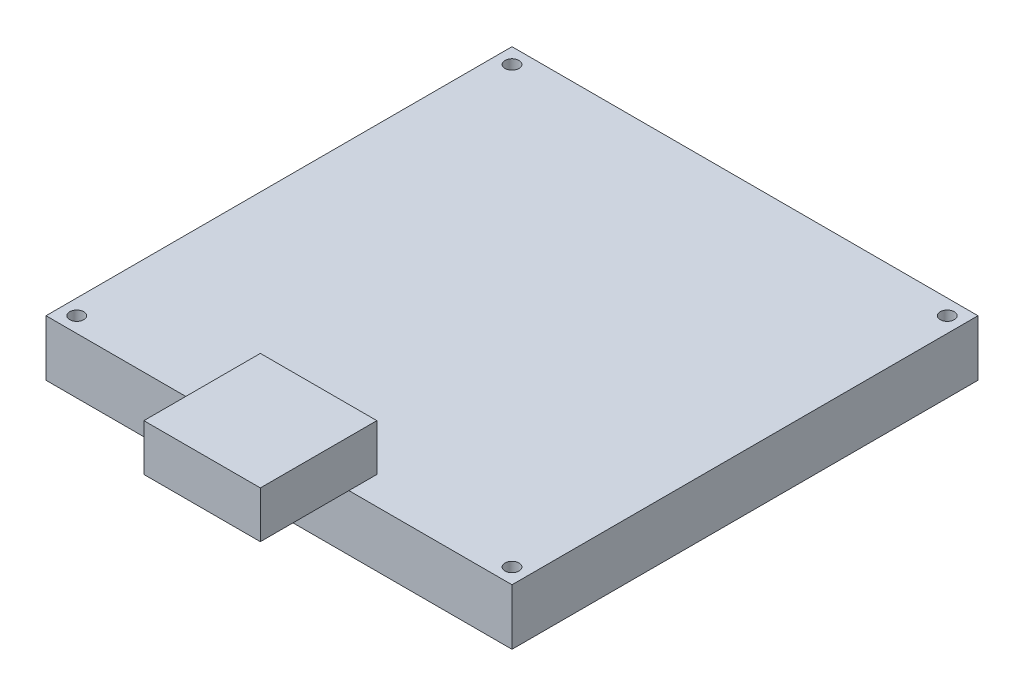
ISO-10303-21;
HEADER;
FILE_DESCRIPTION(('STEP AP214'),'2;1');
FILE_NAME('part.step','',(''),(''),'','','');
FILE_SCHEMA(('AUTOMOTIVE_DESIGN { 1 0 10303 214 1 1 1 1 }'));
ENDSEC;
DATA;
#1=APPLICATION_CONTEXT('core data for automotive mechanical design processes');
#2=APPLICATION_PROTOCOL_DEFINITION('international standard','automotive_design',2000,#1);
#3=PRODUCT_CONTEXT('',#1,'mechanical');
#4=PRODUCT('Part','Part','',(#3));
#5=PRODUCT_RELATED_PRODUCT_CATEGORY('part','',(#4));
#6=PRODUCT_DEFINITION_FORMATION('','',#4);
#7=PRODUCT_DEFINITION_CONTEXT('part definition',#1,'design');
#8=PRODUCT_DEFINITION('design','',#6,#7);
#9=PRODUCT_DEFINITION_SHAPE('','',#8);
#10=(LENGTH_UNIT() NAMED_UNIT(*) SI_UNIT(.MILLI.,.METRE.));
#11=(NAMED_UNIT(*) PLANE_ANGLE_UNIT() SI_UNIT($,.RADIAN.));
#12=(NAMED_UNIT(*) SI_UNIT($,.STERADIAN.) SOLID_ANGLE_UNIT());
#13=UNCERTAINTY_MEASURE_WITH_UNIT(LENGTH_MEASURE(1.E-05),#10,'distance_accuracy_value','');
#14=(GEOMETRIC_REPRESENTATION_CONTEXT(3) GLOBAL_UNCERTAINTY_ASSIGNED_CONTEXT((#13)) GLOBAL_UNIT_ASSIGNED_CONTEXT((#10,
#11,#12)) REPRESENTATION_CONTEXT('',''));
#15=CARTESIAN_POINT('',(0.,0.,0.));
#16=DIRECTION('',(0.,0.,1.));
#17=DIRECTION('',(1.,0.,0.));
#18=AXIS2_PLACEMENT_3D('',#15,#16,#17);
#19=CARTESIAN_POINT('',(0.,12.,0.));
#20=DIRECTION('',(0.,1.,0.));
#21=DIRECTION('',(0.,0.,1.));
#22=AXIS2_PLACEMENT_3D('',#19,#20,#21);
#23=PLANE('',#22);
#24=DIRECTION('',(0.,0.,-1.));
#25=VECTOR('',#24,1.);
#26=CARTESIAN_POINT('',(65.,12.,-6.));
#27=LINE('',#26,#25);
#28=CARTESIAN_POINT('',(65.,12.,0.));
#29=VERTEX_POINT('',#28);
#30=CARTESIAN_POINT('',(65.,12.,-6.));
#31=VERTEX_POINT('',#30);
#32=EDGE_CURVE('E12',#29,#31,#27,.T.);
#33=ORIENTED_EDGE('',*,*,#32,.F.);
#34=DIRECTION('',(1.,0.,0.));
#35=VECTOR('',#34,1.);
#36=CARTESIAN_POINT('',(0.,12.,0.));
#37=LINE('',#36,#35);
#38=CARTESIAN_POINT('',(100.,12.,0.));
#39=VERTEX_POINT('',#38);
#40=EDGE_CURVE('E167',#29,#39,#37,.T.);
#41=ORIENTED_EDGE('',*,*,#40,.T.);
#42=DIRECTION('',(0.,0.,-1.));
#43=VECTOR('',#42,1.);
#44=CARTESIAN_POINT('',(100.,12.,0.));
#45=LINE('',#44,#43);
#46=CARTESIAN_POINT('',(100.,12.,-100.));
#47=VERTEX_POINT('',#46);
#48=EDGE_CURVE('E171',#39,#47,#45,.T.);
#49=ORIENTED_EDGE('',*,*,#48,.T.);
#50=DIRECTION('',(1.,0.,0.));
#51=VECTOR('',#50,1.);
#52=CARTESIAN_POINT('',(0.,12.,-100.));
#53=LINE('',#52,#51);
#54=CARTESIAN_POINT('',(0.,12.,-100.));
#55=VERTEX_POINT('',#54);
#56=EDGE_CURVE('E174',#55,#47,#53,.T.);
#57=ORIENTED_EDGE('',*,*,#56,.F.);
#58=DIRECTION('',(0.,0.,-1.));
#59=VECTOR('',#58,1.);
#60=CARTESIAN_POINT('',(0.,12.,0.));
#61=LINE('',#60,#59);
#62=CARTESIAN_POINT('',(0.,12.,0.));
#63=VERTEX_POINT('',#62);
#64=EDGE_CURVE('E177',#63,#55,#61,.T.);
#65=ORIENTED_EDGE('',*,*,#64,.F.);
#66=CARTESIAN_POINT('',(40.,12.,0.));
#67=VERTEX_POINT('',#66);
#68=EDGE_CURVE('E168',#63,#67,#37,.T.);
#69=ORIENTED_EDGE('',*,*,#68,.T.);
#70=DIRECTION('',(0.,0.,1.));
#71=VECTOR('',#70,1.);
#72=CARTESIAN_POINT('',(40.,12.,-6.));
#73=LINE('',#72,#71);
#74=CARTESIAN_POINT('',(40.,12.,-6.));
#75=VERTEX_POINT('',#74);
#76=EDGE_CURVE('E387',#75,#67,#73,.T.);
#77=ORIENTED_EDGE('',*,*,#76,.F.);
#78=DIRECTION('',(-1.,0.,0.));
#79=VECTOR('',#78,1.);
#80=CARTESIAN_POINT('',(65.,12.,-6.));
#81=LINE('',#80,#79);
#82=EDGE_CURVE('E70',#31,#75,#81,.T.);
#83=ORIENTED_EDGE('',*,*,#82,.F.);
#84=EDGE_LOOP('',(#33,#41,#49,#57,#65,#69,#77,#83));
#85=FACE_BOUND('',#84,.T.);
#86=CARTESIAN_POINT('',(96.7,12.,-96.7));
#87=DIRECTION('',(0.,1.,0.));
#88=DIRECTION('',(0.,0.,1.));
#89=AXIS2_PLACEMENT_3D('',#86,#87,#88);
#90=CIRCLE('',#89,1.5);
#91=CARTESIAN_POINT('',(96.7,12.,-95.2));
#92=VERTEX_POINT('',#91);
#93=EDGE_CURVE('E164',#92,#92,#90,.T.);
#94=ORIENTED_EDGE('',*,*,#93,.F.);
#95=EDGE_LOOP('',(#94));
#96=FACE_BOUND('',#95,.T.);
#97=CARTESIAN_POINT('',(96.7,12.,-3.3));
#98=DIRECTION('',(0.,1.,0.));
#99=DIRECTION('',(0.,0.,1.));
#100=AXIS2_PLACEMENT_3D('',#97,#98,#99);
#101=CIRCLE('',#100,1.5);
#102=CARTESIAN_POINT('',(96.7,12.,-1.8));
#103=VERTEX_POINT('',#102);
#104=EDGE_CURVE('E160',#103,#103,#101,.T.);
#105=ORIENTED_EDGE('',*,*,#104,.F.);
#106=EDGE_LOOP('',(#105));
#107=FACE_BOUND('',#106,.T.);
#108=CARTESIAN_POINT('',(3.3,12.,-3.3));
#109=DIRECTION('',(0.,1.,0.));
#110=DIRECTION('',(0.,0.,1.));
#111=AXIS2_PLACEMENT_3D('',#108,#109,#110);
#112=CIRCLE('',#111,1.5);
#113=CARTESIAN_POINT('',(3.3,12.,-1.8));
#114=VERTEX_POINT('',#113);
#115=EDGE_CURVE('E157',#114,#114,#112,.T.);
#116=ORIENTED_EDGE('',*,*,#115,.F.);
#117=EDGE_LOOP('',(#116));
#118=FACE_BOUND('',#117,.T.);
#119=CARTESIAN_POINT('',(3.3,12.,-96.7));
#120=DIRECTION('',(0.,1.,0.));
#121=DIRECTION('',(0.,0.,1.));
#122=AXIS2_PLACEMENT_3D('',#119,#120,#121);
#123=CIRCLE('',#122,1.5);
#124=CARTESIAN_POINT('',(3.3,12.,-95.2));
#125=VERTEX_POINT('',#124);
#126=EDGE_CURVE('E148',#125,#125,#123,.T.);
#127=ORIENTED_EDGE('',*,*,#126,.F.);
#128=EDGE_LOOP('',(#127));
#129=FACE_BOUND('',#128,.T.);
#130=ADVANCED_FACE('F53',(#85,#96,#107,#118,#129),#23,.T.);
#131=CARTESIAN_POINT('',(0.,0.,0.));
#132=DIRECTION('',(0.,1.,0.));
#133=DIRECTION('',(0.,0.,1.));
#134=AXIS2_PLACEMENT_3D('',#131,#132,#133);
#135=PLANE('',#134);
#136=CARTESIAN_POINT('',(3.3,0.,-3.3));
#137=DIRECTION('',(0.,1.,0.));
#138=DIRECTION('',(0.,0.,1.));
#139=AXIS2_PLACEMENT_3D('',#136,#137,#138);
#140=CIRCLE('',#139,1.5);
#141=CARTESIAN_POINT('',(3.3,0.,-1.8));
#142=VERTEX_POINT('',#141);
#143=EDGE_CURVE('E155',#142,#142,#140,.T.);
#144=ORIENTED_EDGE('',*,*,#143,.T.);
#145=EDGE_LOOP('',(#144));
#146=FACE_BOUND('',#145,.T.);
#147=CARTESIAN_POINT('',(96.7,0.,-3.3));
#148=DIRECTION('',(0.,1.,0.));
#149=DIRECTION('',(0.,0.,1.));
#150=AXIS2_PLACEMENT_3D('',#147,#148,#149);
#151=CIRCLE('',#150,1.5);
#152=CARTESIAN_POINT('',(96.7,0.,-1.8));
#153=VERTEX_POINT('',#152);
#154=EDGE_CURVE('E183',#153,#153,#151,.T.);
#155=ORIENTED_EDGE('',*,*,#154,.T.);
#156=EDGE_LOOP('',(#155));
#157=FACE_BOUND('',#156,.T.);
#158=CARTESIAN_POINT('',(96.7,0.,-96.7));
#159=DIRECTION('',(0.,1.,0.));
#160=DIRECTION('',(0.,0.,1.));
#161=AXIS2_PLACEMENT_3D('',#158,#159,#160);
#162=CIRCLE('',#161,1.5);
#163=CARTESIAN_POINT('',(96.7,0.,-95.2));
#164=VERTEX_POINT('',#163);
#165=EDGE_CURVE('E186',#164,#164,#162,.T.);
#166=ORIENTED_EDGE('',*,*,#165,.T.);
#167=EDGE_LOOP('',(#166));
#168=FACE_BOUND('',#167,.T.);
#169=DIRECTION('',(1.,0.,0.));
#170=VECTOR('',#169,1.);
#171=CARTESIAN_POINT('',(0.,0.,0.));
#172=LINE('',#171,#170);
#173=CARTESIAN_POINT('',(0.,0.,0.));
#174=VERTEX_POINT('',#173);
#175=CARTESIAN_POINT('',(100.,0.,0.));
#176=VERTEX_POINT('',#175);
#177=EDGE_CURVE('E189',#174,#176,#172,.T.);
#178=ORIENTED_EDGE('',*,*,#177,.F.);
#179=DIRECTION('',(0.,0.,-1.));
#180=VECTOR('',#179,1.);
#181=CARTESIAN_POINT('',(0.,0.,0.));
#182=LINE('',#181,#180);
#183=CARTESIAN_POINT('',(0.,0.,-100.));
#184=VERTEX_POINT('',#183);
#185=EDGE_CURVE('E161',#174,#184,#182,.T.);
#186=ORIENTED_EDGE('',*,*,#185,.T.);
#187=DIRECTION('',(1.,0.,0.));
#188=VECTOR('',#187,1.);
#189=CARTESIAN_POINT('',(0.,0.,-100.));
#190=LINE('',#189,#188);
#191=CARTESIAN_POINT('',(100.,0.,-100.));
#192=VERTEX_POINT('',#191);
#193=EDGE_CURVE('E195',#184,#192,#190,.T.);
#194=ORIENTED_EDGE('',*,*,#193,.T.);
#195=DIRECTION('',(0.,0.,-1.));
#196=VECTOR('',#195,1.);
#197=CARTESIAN_POINT('',(100.,0.,0.));
#198=LINE('',#197,#196);
#199=EDGE_CURVE('E192',#176,#192,#198,.T.);
#200=ORIENTED_EDGE('',*,*,#199,.F.);
#201=EDGE_LOOP('',(#178,#186,#194,#200));
#202=FACE_BOUND('',#201,.T.);
#203=CARTESIAN_POINT('',(3.3,0.,-96.7));
#204=DIRECTION('',(0.,1.,0.));
#205=DIRECTION('',(0.,0.,1.));
#206=AXIS2_PLACEMENT_3D('',#203,#204,#205);
#207=CIRCLE('',#206,1.5);
#208=CARTESIAN_POINT('',(3.3,0.,-95.2));
#209=VERTEX_POINT('',#208);
#210=EDGE_CURVE('E145',#209,#209,#207,.T.);
#211=ORIENTED_EDGE('',*,*,#210,.T.);
#212=EDGE_LOOP('',(#211));
#213=FACE_BOUND('',#212,.T.);
#214=ADVANCED_FACE('F217',(#146,#157,#168,#202,#213),#135,.F.);
#215=CARTESIAN_POINT('',(0.,12.,0.));
#216=DIRECTION('',(0.,0.,-1.));
#217=DIRECTION('',(-1.,0.,0.));
#218=AXIS2_PLACEMENT_3D('',#215,#216,#217);
#219=PLANE('',#218);
#220=ORIENTED_EDGE('',*,*,#177,.T.);
#221=DIRECTION('',(0.,-1.,0.));
#222=VECTOR('',#221,1.);
#223=CARTESIAN_POINT('',(100.,12.,0.));
#224=LINE('',#223,#222);
#225=EDGE_CURVE('E57',#39,#176,#224,.T.);
#226=ORIENTED_EDGE('',*,*,#225,.F.);
#227=ORIENTED_EDGE('',*,*,#40,.F.);
#228=EDGE_CURVE('E172',#67,#29,#37,.T.);
#229=ORIENTED_EDGE('',*,*,#228,.F.);
#230=ORIENTED_EDGE('',*,*,#68,.F.);
#231=DIRECTION('',(0.,-1.,0.));
#232=VECTOR('',#231,1.);
#233=CARTESIAN_POINT('',(0.,12.,0.));
#234=LINE('',#233,#232);
#235=EDGE_CURVE('E180',#63,#174,#234,.T.);
#236=ORIENTED_EDGE('',*,*,#235,.T.);
#237=EDGE_LOOP('',(#220,#226,#227,#229,#230,#236));
#238=FACE_BOUND('',#237,.T.);
#239=ADVANCED_FACE('F213',(#238),#219,.F.);
#240=CARTESIAN_POINT('',(100.,12.,0.));
#241=DIRECTION('',(-1.,0.,0.));
#242=DIRECTION('',(0.,0.,1.));
#243=AXIS2_PLACEMENT_3D('',#240,#241,#242);
#244=PLANE('',#243);
#245=ORIENTED_EDGE('',*,*,#199,.T.);
#246=DIRECTION('',(0.,-1.,0.));
#247=VECTOR('',#246,1.);
#248=CARTESIAN_POINT('',(100.,12.,-100.));
#249=LINE('',#248,#247);
#250=EDGE_CURVE('E202',#47,#192,#249,.T.);
#251=ORIENTED_EDGE('',*,*,#250,.F.);
#252=ORIENTED_EDGE('',*,*,#48,.F.);
#253=ORIENTED_EDGE('',*,*,#225,.T.);
#254=EDGE_LOOP('',(#245,#251,#252,#253));
#255=FACE_BOUND('',#254,.T.);
#256=ADVANCED_FACE('F210',(#255),#244,.F.);
#257=CARTESIAN_POINT('',(0.,12.,-100.));
#258=DIRECTION('',(0.,0.,-1.));
#259=DIRECTION('',(-1.,0.,0.));
#260=AXIS2_PLACEMENT_3D('',#257,#258,#259);
#261=PLANE('',#260);
#262=ORIENTED_EDGE('',*,*,#193,.F.);
#263=DIRECTION('',(0.,-1.,0.));
#264=VECTOR('',#263,1.);
#265=CARTESIAN_POINT('',(0.,12.,-100.));
#266=LINE('',#265,#264);
#267=EDGE_CURVE('E201',#55,#184,#266,.T.);
#268=ORIENTED_EDGE('',*,*,#267,.F.);
#269=ORIENTED_EDGE('',*,*,#56,.T.);
#270=ORIENTED_EDGE('',*,*,#250,.T.);
#271=EDGE_LOOP('',(#262,#268,#269,#270));
#272=FACE_BOUND('',#271,.T.);
#273=ADVANCED_FACE('F223',(#272),#261,.T.);
#274=CARTESIAN_POINT('',(96.7,12.,-96.7));
#275=DIRECTION('',(0.,-1.,0.));
#276=DIRECTION('',(0.,0.,-1.));
#277=AXIS2_PLACEMENT_3D('',#274,#275,#276);
#278=CYLINDRICAL_SURFACE('',#277,1.5);
#279=ORIENTED_EDGE('',*,*,#93,.T.);
#280=EDGE_LOOP('',(#279));
#281=FACE_BOUND('',#280,.T.);
#282=ORIENTED_EDGE('',*,*,#165,.F.);
#283=EDGE_LOOP('',(#282));
#284=FACE_BOUND('',#283,.T.);
#285=ADVANCED_FACE('F225',(#281,#284),#278,.F.);
#286=CARTESIAN_POINT('',(96.7,12.,-3.3));
#287=DIRECTION('',(0.,-1.,0.));
#288=DIRECTION('',(0.,0.,-1.));
#289=AXIS2_PLACEMENT_3D('',#286,#287,#288);
#290=CYLINDRICAL_SURFACE('',#289,1.5);
#291=ORIENTED_EDGE('',*,*,#104,.T.);
#292=EDGE_LOOP('',(#291));
#293=FACE_BOUND('',#292,.T.);
#294=ORIENTED_EDGE('',*,*,#154,.F.);
#295=EDGE_LOOP('',(#294));
#296=FACE_BOUND('',#295,.T.);
#297=ADVANCED_FACE('F231',(#293,#296),#290,.F.);
#298=CARTESIAN_POINT('',(3.3,12.,-3.3));
#299=DIRECTION('',(0.,-1.,0.));
#300=DIRECTION('',(0.,0.,-1.));
#301=AXIS2_PLACEMENT_3D('',#298,#299,#300);
#302=CYLINDRICAL_SURFACE('',#301,1.5);
#303=ORIENTED_EDGE('',*,*,#115,.T.);
#304=EDGE_LOOP('',(#303));
#305=FACE_BOUND('',#304,.T.);
#306=ORIENTED_EDGE('',*,*,#143,.F.);
#307=EDGE_LOOP('',(#306));
#308=FACE_BOUND('',#307,.T.);
#309=ADVANCED_FACE('F55',(#305,#308),#302,.F.);
#310=CARTESIAN_POINT('',(0.,12.,0.));
#311=DIRECTION('',(-1.,0.,0.));
#312=DIRECTION('',(0.,0.,1.));
#313=AXIS2_PLACEMENT_3D('',#310,#311,#312);
#314=PLANE('',#313);
#315=ORIENTED_EDGE('',*,*,#185,.F.);
#316=ORIENTED_EDGE('',*,*,#235,.F.);
#317=ORIENTED_EDGE('',*,*,#64,.T.);
#318=ORIENTED_EDGE('',*,*,#267,.T.);
#319=EDGE_LOOP('',(#315,#316,#317,#318));
#320=FACE_BOUND('',#319,.T.);
#321=ADVANCED_FACE('F220',(#320),#314,.T.);
#322=CARTESIAN_POINT('',(3.3,12.,-96.7));
#323=DIRECTION('',(0.,-1.,0.));
#324=DIRECTION('',(0.,0.,-1.));
#325=AXIS2_PLACEMENT_3D('',#322,#323,#324);
#326=CYLINDRICAL_SURFACE('',#325,1.5);
#327=ORIENTED_EDGE('',*,*,#126,.T.);
#328=EDGE_LOOP('',(#327));
#329=FACE_BOUND('',#328,.T.);
#330=ORIENTED_EDGE('',*,*,#210,.F.);
#331=EDGE_LOOP('',(#330));
#332=FACE_BOUND('',#331,.T.);
#333=ADVANCED_FACE('F245',(#329,#332),#326,.F.);
#334=CARTESIAN_POINT('',(65.,22.,-6.));
#335=DIRECTION('',(-1.,0.,0.));
#336=DIRECTION('',(0.,0.,1.));
#337=AXIS2_PLACEMENT_3D('',#334,#335,#336);
#338=PLANE('',#337);
#339=CARTESIAN_POINT('',(65.,12.,19.));
#340=VERTEX_POINT('',#339);
#341=EDGE_CURVE('E63',#340,#29,#27,.T.);
#342=ORIENTED_EDGE('',*,*,#341,.T.);
#343=ORIENTED_EDGE('',*,*,#32,.T.);
#344=DIRECTION('',(0.,-1.,0.));
#345=VECTOR('',#344,1.);
#346=CARTESIAN_POINT('',(65.,22.,-6.));
#347=LINE('',#346,#345);
#348=CARTESIAN_POINT('',(65.,22.,-6.));
#349=VERTEX_POINT('',#348);
#350=EDGE_CURVE('E126',#349,#31,#347,.T.);
#351=ORIENTED_EDGE('',*,*,#350,.F.);
#352=DIRECTION('',(0.,0.,-1.));
#353=VECTOR('',#352,1.);
#354=CARTESIAN_POINT('',(65.,22.,-6.));
#355=LINE('',#354,#353);
#356=CARTESIAN_POINT('',(65.,22.,19.));
#357=VERTEX_POINT('',#356);
#358=EDGE_CURVE('E132',#357,#349,#355,.T.);
#359=ORIENTED_EDGE('',*,*,#358,.F.);
#360=DIRECTION('',(0.,-1.,0.));
#361=VECTOR('',#360,1.);
#362=CARTESIAN_POINT('',(65.,22.,19.));
#363=LINE('',#362,#361);
#364=EDGE_CURVE('E392',#357,#340,#363,.T.);
#365=ORIENTED_EDGE('',*,*,#364,.T.);
#366=EDGE_LOOP('',(#342,#343,#351,#359,#365));
#367=FACE_BOUND('',#366,.T.);
#368=ADVANCED_FACE('F144',(#367),#338,.F.);
#369=CARTESIAN_POINT('',(65.,22.,-6.));
#370=DIRECTION('',(0.,0.,1.));
#371=DIRECTION('',(1.,0.,0.));
#372=AXIS2_PLACEMENT_3D('',#369,#370,#371);
#373=PLANE('',#372);
#374=ORIENTED_EDGE('',*,*,#82,.T.);
#375=DIRECTION('',(0.,-1.,0.));
#376=VECTOR('',#375,1.);
#377=CARTESIAN_POINT('',(40.,22.,-6.));
#378=LINE('',#377,#376);
#379=CARTESIAN_POINT('',(40.,22.,-6.));
#380=VERTEX_POINT('',#379);
#381=EDGE_CURVE('E128',#380,#75,#378,.T.);
#382=ORIENTED_EDGE('',*,*,#381,.F.);
#383=DIRECTION('',(-1.,0.,0.));
#384=VECTOR('',#383,1.);
#385=CARTESIAN_POINT('',(65.,22.,-6.));
#386=LINE('',#385,#384);
#387=EDGE_CURVE('E122',#349,#380,#386,.T.);
#388=ORIENTED_EDGE('',*,*,#387,.F.);
#389=ORIENTED_EDGE('',*,*,#350,.T.);
#390=EDGE_LOOP('',(#374,#382,#388,#389));
#391=FACE_BOUND('',#390,.T.);
#392=ADVANCED_FACE('F124',(#391),#373,.F.);
#393=CARTESIAN_POINT('',(40.,22.,-6.));
#394=DIRECTION('',(1.,0.,0.));
#395=DIRECTION('',(0.,0.,-1.));
#396=AXIS2_PLACEMENT_3D('',#393,#394,#395);
#397=PLANE('',#396);
#398=ORIENTED_EDGE('',*,*,#76,.T.);
#399=CARTESIAN_POINT('',(40.,12.,19.));
#400=VERTEX_POINT('',#399);
#401=EDGE_CURVE('E382',#67,#400,#73,.T.);
#402=ORIENTED_EDGE('',*,*,#401,.T.);
#403=DIRECTION('',(0.,-1.,0.));
#404=VECTOR('',#403,1.);
#405=CARTESIAN_POINT('',(40.,22.,19.));
#406=LINE('',#405,#404);
#407=CARTESIAN_POINT('',(40.,22.,19.));
#408=VERTEX_POINT('',#407);
#409=EDGE_CURVE('E150',#408,#400,#406,.T.);
#410=ORIENTED_EDGE('',*,*,#409,.F.);
#411=DIRECTION('',(0.,0.,1.));
#412=VECTOR('',#411,1.);
#413=CARTESIAN_POINT('',(40.,22.,-6.));
#414=LINE('',#413,#412);
#415=EDGE_CURVE('E131',#380,#408,#414,.T.);
#416=ORIENTED_EDGE('',*,*,#415,.F.);
#417=ORIENTED_EDGE('',*,*,#381,.T.);
#418=EDGE_LOOP('',(#398,#402,#410,#416,#417));
#419=FACE_BOUND('',#418,.T.);
#420=ADVANCED_FACE('F335',(#419),#397,.F.);
#421=CARTESIAN_POINT('',(65.,22.,19.));
#422=DIRECTION('',(0.,0.,-1.));
#423=DIRECTION('',(-1.,0.,0.));
#424=AXIS2_PLACEMENT_3D('',#421,#422,#423);
#425=PLANE('',#424);
#426=DIRECTION('',(1.,0.,0.));
#427=VECTOR('',#426,1.);
#428=CARTESIAN_POINT('',(65.,12.,19.));
#429=LINE('',#428,#427);
#430=EDGE_CURVE('E141',#400,#340,#429,.T.);
#431=ORIENTED_EDGE('',*,*,#430,.T.);
#432=ORIENTED_EDGE('',*,*,#364,.F.);
#433=DIRECTION('',(1.,0.,0.));
#434=VECTOR('',#433,1.);
#435=CARTESIAN_POINT('',(65.,22.,19.));
#436=LINE('',#435,#434);
#437=EDGE_CURVE('E137',#408,#357,#436,.T.);
#438=ORIENTED_EDGE('',*,*,#437,.F.);
#439=ORIENTED_EDGE('',*,*,#409,.T.);
#440=EDGE_LOOP('',(#431,#432,#438,#439));
#441=FACE_BOUND('',#440,.T.);
#442=ADVANCED_FACE('F342',(#441),#425,.F.);
#443=CARTESIAN_POINT('',(0.,22.,0.));
#444=DIRECTION('',(0.,-1.,0.));
#445=DIRECTION('',(0.,0.,-1.));
#446=AXIS2_PLACEMENT_3D('',#443,#444,#445);
#447=PLANE('',#446);
#448=ORIENTED_EDGE('',*,*,#358,.T.);
#449=ORIENTED_EDGE('',*,*,#387,.T.);
#450=ORIENTED_EDGE('',*,*,#415,.T.);
#451=ORIENTED_EDGE('',*,*,#437,.T.);
#452=EDGE_LOOP('',(#448,#449,#450,#451));
#453=FACE_BOUND('',#452,.T.);
#454=ADVANCED_FACE('F135',(#453),#447,.F.);
#455=CARTESIAN_POINT('',(0.,12.,0.));
#456=DIRECTION('',(0.,-1.,0.));
#457=DIRECTION('',(0.,0.,-1.));
#458=AXIS2_PLACEMENT_3D('',#455,#456,#457);
#459=PLANE('',#458);
#460=ORIENTED_EDGE('',*,*,#401,.F.);
#461=ORIENTED_EDGE('',*,*,#228,.T.);
#462=ORIENTED_EDGE('',*,*,#341,.F.);
#463=ORIENTED_EDGE('',*,*,#430,.F.);
#464=EDGE_LOOP('',(#460,#461,#462,#463));
#465=FACE_BOUND('',#464,.T.);
#466=ADVANCED_FACE('F357',(#465),#459,.T.);
#467=CLOSED_SHELL('',(#130,#214,#239,#256,#273,#285,#297,#309,#321,#333,#368,#392,#420,#442,
#454,#466));
#468=MANIFOLD_SOLID_BREP('B2',#467);
#469=ADVANCED_BREP_SHAPE_REPRESENTATION('',(#18,#468),#14);
#470=SHAPE_DEFINITION_REPRESENTATION(#9,#469);
ENDSEC;
END-ISO-10303-21;
